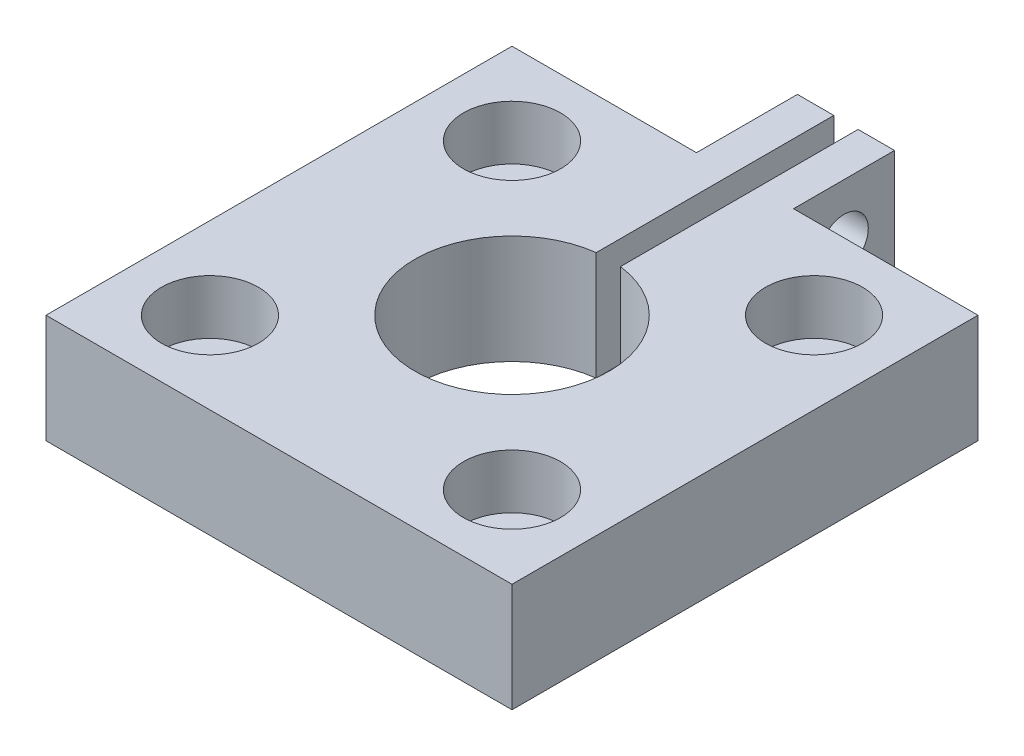
ISO-10303-21;
HEADER;
FILE_DESCRIPTION(('STEP AP214'),'2;1');
FILE_NAME('part.step','',(''),(''),'','','');
FILE_SCHEMA(('AUTOMOTIVE_DESIGN { 1 0 10303 214 1 1 1 1 }'));
ENDSEC;
DATA;
#1=APPLICATION_CONTEXT('core data for automotive mechanical design processes');
#2=APPLICATION_PROTOCOL_DEFINITION('international standard','automotive_design',2000,#1);
#3=PRODUCT_CONTEXT('',#1,'mechanical');
#4=PRODUCT('Part','Part','',(#3));
#5=PRODUCT_RELATED_PRODUCT_CATEGORY('part','',(#4));
#6=PRODUCT_DEFINITION_FORMATION('','',#4);
#7=PRODUCT_DEFINITION_CONTEXT('part definition',#1,'design');
#8=PRODUCT_DEFINITION('design','',#6,#7);
#9=PRODUCT_DEFINITION_SHAPE('','',#8);
#10=(LENGTH_UNIT() NAMED_UNIT(*) SI_UNIT(.MILLI.,.METRE.));
#11=(NAMED_UNIT(*) PLANE_ANGLE_UNIT() SI_UNIT($,.RADIAN.));
#12=(NAMED_UNIT(*) SI_UNIT($,.STERADIAN.) SOLID_ANGLE_UNIT());
#13=UNCERTAINTY_MEASURE_WITH_UNIT(LENGTH_MEASURE(1.E-05),#10,'distance_accuracy_value','');
#14=(GEOMETRIC_REPRESENTATION_CONTEXT(3) GLOBAL_UNCERTAINTY_ASSIGNED_CONTEXT((#13)) GLOBAL_UNIT_ASSIGNED_CONTEXT((#10,
#11,#12)) REPRESENTATION_CONTEXT('',''));
#15=CARTESIAN_POINT('',(0.,0.,0.));
#16=DIRECTION('',(0.,0.,1.));
#17=DIRECTION('',(1.,0.,0.));
#18=AXIS2_PLACEMENT_3D('',#15,#16,#17);
#19=CARTESIAN_POINT('',(4.93914086658801,0.,4.93914086658806));
#20=DIRECTION('',(0.,1.,0.));
#21=DIRECTION('',(0.,0.,1.));
#22=AXIS2_PLACEMENT_3D('',#19,#20,#21);
#23=CYLINDRICAL_SURFACE('',#22,0.79375);
#24=CARTESIAN_POINT('',(4.93914086658801,0.,4.93914086658806));
#25=DIRECTION('',(0.,1.,0.));
#26=DIRECTION('',(0.,0.,1.));
#27=AXIS2_PLACEMENT_3D('',#24,#25,#26);
#28=CIRCLE('',#27,0.79375);
#29=CARTESIAN_POINT('',(4.93914086658801,0.,5.73289086658806));
#30=VERTEX_POINT('',#29);
#31=EDGE_CURVE('E260',#30,#30,#28,.T.);
#32=ORIENTED_EDGE('',*,*,#31,.F.);
#33=EDGE_LOOP('',(#32));
#34=FACE_BOUND('',#33,.T.);
#35=CARTESIAN_POINT('',(4.93914086658801,1.778,4.93914086658806));
#36=DIRECTION('',(0.,1.,0.));
#37=DIRECTION('',(0.,0.,1.));
#38=AXIS2_PLACEMENT_3D('',#35,#36,#37);
#39=CIRCLE('',#38,0.79375);
#40=CARTESIAN_POINT('',(4.93914086658801,1.778,5.73289086658806));
#41=VERTEX_POINT('',#40);
#42=EDGE_CURVE('E39',#41,#41,#39,.F.);
#43=ORIENTED_EDGE('',*,*,#42,.F.);
#44=EDGE_LOOP('',(#43));
#45=FACE_BOUND('',#44,.T.);
#46=ADVANCED_FACE('F35',(#34,#45),#23,.F.);
#47=CARTESIAN_POINT('',(-4.93914086658805,0.,4.93914086658801));
#48=DIRECTION('',(0.,1.,0.));
#49=DIRECTION('',(0.,0.,1.));
#50=AXIS2_PLACEMENT_3D('',#47,#48,#49);
#51=CYLINDRICAL_SURFACE('',#50,0.79375);
#52=CARTESIAN_POINT('',(-4.93914086658805,0.,4.93914086658801));
#53=DIRECTION('',(0.,1.,0.));
#54=DIRECTION('',(0.,0.,1.));
#55=AXIS2_PLACEMENT_3D('',#52,#53,#54);
#56=CIRCLE('',#55,0.79375);
#57=CARTESIAN_POINT('',(-4.93914086658805,0.,5.73289086658801));
#58=VERTEX_POINT('',#57);
#59=EDGE_CURVE('E257',#58,#58,#56,.T.);
#60=ORIENTED_EDGE('',*,*,#59,.F.);
#61=EDGE_LOOP('',(#60));
#62=FACE_BOUND('',#61,.T.);
#63=CARTESIAN_POINT('',(-4.93914086658805,1.778,4.93914086658801));
#64=DIRECTION('',(0.,1.,0.));
#65=DIRECTION('',(0.,0.,1.));
#66=AXIS2_PLACEMENT_3D('',#63,#64,#65);
#67=CIRCLE('',#66,0.79375);
#68=CARTESIAN_POINT('',(-4.93914086658805,1.778,5.73289086658801));
#69=VERTEX_POINT('',#68);
#70=EDGE_CURVE('E222',#69,#69,#67,.F.);
#71=ORIENTED_EDGE('',*,*,#70,.F.);
#72=EDGE_LOOP('',(#71));
#73=FACE_BOUND('',#72,.T.);
#74=ADVANCED_FACE('F318',(#62,#73),#51,.F.);
#75=CARTESIAN_POINT('',(4.93914086658806,0.,-4.93914086658801));
#76=DIRECTION('',(0.,1.,0.));
#77=DIRECTION('',(0.,0.,1.));
#78=AXIS2_PLACEMENT_3D('',#75,#76,#77);
#79=CYLINDRICAL_SURFACE('',#78,0.79375);
#80=CARTESIAN_POINT('',(4.93914086658806,0.,-4.93914086658801));
#81=DIRECTION('',(0.,1.,0.));
#82=DIRECTION('',(0.,0.,1.));
#83=AXIS2_PLACEMENT_3D('',#80,#81,#82);
#84=CIRCLE('',#83,0.79375);
#85=CARTESIAN_POINT('',(4.93914086658806,0.,-4.14539086658801));
#86=VERTEX_POINT('',#85);
#87=EDGE_CURVE('E167',#86,#86,#84,.T.);
#88=ORIENTED_EDGE('',*,*,#87,.F.);
#89=EDGE_LOOP('',(#88));
#90=FACE_BOUND('',#89,.T.);
#91=CARTESIAN_POINT('',(4.93914086658806,1.778,-4.93914086658801));
#92=DIRECTION('',(0.,1.,0.));
#93=DIRECTION('',(0.,0.,1.));
#94=AXIS2_PLACEMENT_3D('',#91,#92,#93);
#95=CIRCLE('',#94,0.79375);
#96=CARTESIAN_POINT('',(4.93914086658806,1.778,-4.14539086658801));
#97=VERTEX_POINT('',#96);
#98=EDGE_CURVE('E218',#97,#97,#95,.F.);
#99=ORIENTED_EDGE('',*,*,#98,.F.);
#100=EDGE_LOOP('',(#99));
#101=FACE_BOUND('',#100,.T.);
#102=ADVANCED_FACE('F314',(#90,#101),#79,.F.);
#103=CARTESIAN_POINT('',(-4.93914086658801,0.,-4.93914086658806));
#104=DIRECTION('',(0.,1.,0.));
#105=DIRECTION('',(0.,0.,1.));
#106=AXIS2_PLACEMENT_3D('',#103,#104,#105);
#107=CYLINDRICAL_SURFACE('',#106,0.79375);
#108=CARTESIAN_POINT('',(-4.93914086658801,0.,-4.93914086658806));
#109=DIRECTION('',(0.,1.,0.));
#110=DIRECTION('',(0.,0.,1.));
#111=AXIS2_PLACEMENT_3D('',#108,#109,#110);
#112=CIRCLE('',#111,0.79375);
#113=CARTESIAN_POINT('',(-4.93914086658801,0.,-4.14539086658806));
#114=VERTEX_POINT('',#113);
#115=EDGE_CURVE('E261',#114,#114,#112,.T.);
#116=ORIENTED_EDGE('',*,*,#115,.F.);
#117=EDGE_LOOP('',(#116));
#118=FACE_BOUND('',#117,.T.);
#119=CARTESIAN_POINT('',(-4.93914086658801,1.778,-4.93914086658806));
#120=DIRECTION('',(0.,1.,0.));
#121=DIRECTION('',(0.,0.,1.));
#122=AXIS2_PLACEMENT_3D('',#119,#120,#121);
#123=CIRCLE('',#122,0.79375);
#124=CARTESIAN_POINT('',(-4.93914086658801,1.778,-4.14539086658806));
#125=VERTEX_POINT('',#124);
#126=EDGE_CURVE('E213',#125,#125,#123,.F.);
#127=ORIENTED_EDGE('',*,*,#126,.F.);
#128=EDGE_LOOP('',(#127));
#129=FACE_BOUND('',#128,.T.);
#130=ADVANCED_FACE('F305',(#118,#129),#107,.F.);
#131=CARTESIAN_POINT('',(-1.5875,3.556,0.));
#132=DIRECTION('',(-1.,0.,0.));
#133=DIRECTION('',(0.,0.,1.));
#134=AXIS2_PLACEMENT_3D('',#131,#132,#133);
#135=PLANE('',#134);
#136=CARTESIAN_POINT('',(-1.5875,1.778,-9.271));
#137=DIRECTION('',(1.,0.,0.));
#138=DIRECTION('',(0.,0.,-1.));
#139=AXIS2_PLACEMENT_3D('',#136,#137,#138);
#140=CIRCLE('',#139,0.793749999999999);
#141=CARTESIAN_POINT('',(-1.5875,1.778,-10.06475));
#142=VERTEX_POINT('',#141);
#143=EDGE_CURVE('E212',#142,#142,#140,.T.);
#144=ORIENTED_EDGE('',*,*,#143,.T.);
#145=EDGE_LOOP('',(#144));
#146=FACE_BOUND('',#145,.T.);
#147=DIRECTION('',(0.,0.,-1.));
#148=VECTOR('',#147,1.);
#149=CARTESIAN_POINT('',(-1.5875,0.,0.));
#150=LINE('',#149,#148);
#151=CARTESIAN_POINT('',(-1.5875,0.,-7.62));
#152=VERTEX_POINT('',#151);
#153=CARTESIAN_POINT('',(-1.5875,0.,-10.922));
#154=VERTEX_POINT('',#153);
#155=EDGE_CURVE('E166',#152,#154,#150,.T.);
#156=ORIENTED_EDGE('',*,*,#155,.F.);
#157=DIRECTION('',(0.,-1.,0.));
#158=VECTOR('',#157,1.);
#159=CARTESIAN_POINT('',(-1.5875,3.556,-7.62));
#160=LINE('',#159,#158);
#161=CARTESIAN_POINT('',(-1.5875,3.556,-7.62));
#162=VERTEX_POINT('',#161);
#163=EDGE_CURVE('E11',#162,#152,#160,.T.);
#164=ORIENTED_EDGE('',*,*,#163,.F.);
#165=DIRECTION('',(0.,0.,-1.));
#166=VECTOR('',#165,1.);
#167=CARTESIAN_POINT('',(-1.5875,3.556,0.));
#168=LINE('',#167,#166);
#169=CARTESIAN_POINT('',(-1.5875,3.556,-10.922));
#170=VERTEX_POINT('',#169);
#171=EDGE_CURVE('E269',#162,#170,#168,.T.);
#172=ORIENTED_EDGE('',*,*,#171,.T.);
#173=DIRECTION('',(0.,-1.,0.));
#174=VECTOR('',#173,1.);
#175=CARTESIAN_POINT('',(-1.5875,3.556,-10.922));
#176=LINE('',#175,#174);
#177=EDGE_CURVE('E61',#170,#154,#176,.T.);
#178=ORIENTED_EDGE('',*,*,#177,.T.);
#179=EDGE_LOOP('',(#156,#164,#172,#178));
#180=FACE_BOUND('',#179,.T.);
#181=ADVANCED_FACE('F302',(#146,#180),#135,.T.);
#182=CARTESIAN_POINT('',(0.,3.556,-7.62));
#183=DIRECTION('',(0.,0.,1.));
#184=DIRECTION('',(1.,0.,0.));
#185=AXIS2_PLACEMENT_3D('',#182,#183,#184);
#186=PLANE('',#185);
#187=DIRECTION('',(-1.,0.,0.));
#188=VECTOR('',#187,1.);
#189=CARTESIAN_POINT('',(0.,0.,-7.62));
#190=LINE('',#189,#188);
#191=CARTESIAN_POINT('',(-7.62,0.,-7.62));
#192=VERTEX_POINT('',#191);
#193=EDGE_CURVE('E169',#152,#192,#190,.T.);
#194=ORIENTED_EDGE('',*,*,#193,.T.);
#195=DIRECTION('',(0.,-1.,0.));
#196=VECTOR('',#195,1.);
#197=CARTESIAN_POINT('',(-7.62,3.556,-7.62));
#198=LINE('',#197,#196);
#199=CARTESIAN_POINT('',(-7.62,3.556,-7.62));
#200=VERTEX_POINT('',#199);
#201=EDGE_CURVE('E44',#200,#192,#198,.T.);
#202=ORIENTED_EDGE('',*,*,#201,.F.);
#203=DIRECTION('',(-1.,0.,0.));
#204=VECTOR('',#203,1.);
#205=CARTESIAN_POINT('',(0.,3.556,-7.62));
#206=LINE('',#205,#204);
#207=EDGE_CURVE('E271',#162,#200,#206,.T.);
#208=ORIENTED_EDGE('',*,*,#207,.F.);
#209=ORIENTED_EDGE('',*,*,#163,.T.);
#210=EDGE_LOOP('',(#194,#202,#208,#209));
#211=FACE_BOUND('',#210,.T.);
#212=ADVANCED_FACE('F304',(#211),#186,.F.);
#213=CARTESIAN_POINT('',(-7.62,3.556,0.));
#214=DIRECTION('',(1.,0.,0.));
#215=DIRECTION('',(0.,0.,-1.));
#216=AXIS2_PLACEMENT_3D('',#213,#214,#215);
#217=PLANE('',#216);
#218=DIRECTION('',(0.,0.,1.));
#219=VECTOR('',#218,1.);
#220=CARTESIAN_POINT('',(-7.62,0.,0.));
#221=LINE('',#220,#219);
#222=CARTESIAN_POINT('',(-7.62,0.,7.62));
#223=VERTEX_POINT('',#222);
#224=EDGE_CURVE('E172',#192,#223,#221,.T.);
#225=ORIENTED_EDGE('',*,*,#224,.T.);
#226=DIRECTION('',(0.,-1.,0.));
#227=VECTOR('',#226,1.);
#228=CARTESIAN_POINT('',(-7.62,3.556,7.62));
#229=LINE('',#228,#227);
#230=CARTESIAN_POINT('',(-7.62,3.556,7.62));
#231=VERTEX_POINT('',#230);
#232=EDGE_CURVE('E204',#231,#223,#229,.T.);
#233=ORIENTED_EDGE('',*,*,#232,.F.);
#234=DIRECTION('',(0.,0.,1.));
#235=VECTOR('',#234,1.);
#236=CARTESIAN_POINT('',(-7.62,3.556,0.));
#237=LINE('',#236,#235);
#238=EDGE_CURVE('E274',#200,#231,#237,.T.);
#239=ORIENTED_EDGE('',*,*,#238,.F.);
#240=ORIENTED_EDGE('',*,*,#201,.T.);
#241=EDGE_LOOP('',(#225,#233,#239,#240));
#242=FACE_BOUND('',#241,.T.);
#243=ADVANCED_FACE('F311',(#242),#217,.F.);
#244=CARTESIAN_POINT('',(0.,3.556,7.62));
#245=DIRECTION('',(0.,0.,1.));
#246=DIRECTION('',(1.,0.,0.));
#247=AXIS2_PLACEMENT_3D('',#244,#245,#246);
#248=PLANE('',#247);
#249=DIRECTION('',(-1.,0.,0.));
#250=VECTOR('',#249,1.);
#251=CARTESIAN_POINT('',(0.,0.,7.62));
#252=LINE('',#251,#250);
#253=CARTESIAN_POINT('',(7.62,0.,7.62));
#254=VERTEX_POINT('',#253);
#255=EDGE_CURVE('E175',#254,#223,#252,.T.);
#256=ORIENTED_EDGE('',*,*,#255,.F.);
#257=DIRECTION('',(0.,-1.,0.));
#258=VECTOR('',#257,1.);
#259=CARTESIAN_POINT('',(7.62,3.556,7.62));
#260=LINE('',#259,#258);
#261=CARTESIAN_POINT('',(7.62,3.556,7.62));
#262=VERTEX_POINT('',#261);
#263=EDGE_CURVE('E202',#262,#254,#260,.T.);
#264=ORIENTED_EDGE('',*,*,#263,.F.);
#265=DIRECTION('',(-1.,0.,0.));
#266=VECTOR('',#265,1.);
#267=CARTESIAN_POINT('',(0.,3.556,7.62));
#268=LINE('',#267,#266);
#269=EDGE_CURVE('E276',#262,#231,#268,.T.);
#270=ORIENTED_EDGE('',*,*,#269,.T.);
#271=ORIENTED_EDGE('',*,*,#232,.T.);
#272=EDGE_LOOP('',(#256,#264,#270,#271));
#273=FACE_BOUND('',#272,.T.);
#274=ADVANCED_FACE('F357',(#273),#248,.T.);
#275=CARTESIAN_POINT('',(7.62,3.556,0.));
#276=DIRECTION('',(1.,0.,0.));
#277=DIRECTION('',(0.,0.,-1.));
#278=AXIS2_PLACEMENT_3D('',#275,#276,#277);
#279=PLANE('',#278);
#280=DIRECTION('',(0.,0.,1.));
#281=VECTOR('',#280,1.);
#282=CARTESIAN_POINT('',(7.62,0.,0.));
#283=LINE('',#282,#281);
#284=CARTESIAN_POINT('',(7.62,0.,-7.62));
#285=VERTEX_POINT('',#284);
#286=EDGE_CURVE('E178',#285,#254,#283,.T.);
#287=ORIENTED_EDGE('',*,*,#286,.F.);
#288=DIRECTION('',(0.,-1.,0.));
#289=VECTOR('',#288,1.);
#290=CARTESIAN_POINT('',(7.62,3.556,-7.62));
#291=LINE('',#290,#289);
#292=CARTESIAN_POINT('',(7.62,3.556,-7.62));
#293=VERTEX_POINT('',#292);
#294=EDGE_CURVE('E200',#293,#285,#291,.T.);
#295=ORIENTED_EDGE('',*,*,#294,.F.);
#296=DIRECTION('',(0.,0.,1.));
#297=VECTOR('',#296,1.);
#298=CARTESIAN_POINT('',(7.62,3.556,0.));
#299=LINE('',#298,#297);
#300=EDGE_CURVE('E279',#293,#262,#299,.T.);
#301=ORIENTED_EDGE('',*,*,#300,.T.);
#302=ORIENTED_EDGE('',*,*,#263,.T.);
#303=EDGE_LOOP('',(#287,#295,#301,#302));
#304=FACE_BOUND('',#303,.T.);
#305=ADVANCED_FACE('F354',(#304),#279,.T.);
#306=CARTESIAN_POINT('',(0.,3.556,-7.62));
#307=DIRECTION('',(0.,0.,1.));
#308=DIRECTION('',(1.,0.,0.));
#309=AXIS2_PLACEMENT_3D('',#306,#307,#308);
#310=PLANE('',#309);
#311=DIRECTION('',(-1.,0.,0.));
#312=VECTOR('',#311,1.);
#313=CARTESIAN_POINT('',(0.,0.,-7.62));
#314=LINE('',#313,#312);
#315=CARTESIAN_POINT('',(1.5875,0.,-7.62));
#316=VERTEX_POINT('',#315);
#317=EDGE_CURVE('E181',#285,#316,#314,.T.);
#318=ORIENTED_EDGE('',*,*,#317,.T.);
#319=DIRECTION('',(0.,-1.,0.));
#320=VECTOR('',#319,1.);
#321=CARTESIAN_POINT('',(1.5875,3.556,-7.62));
#322=LINE('',#321,#320);
#323=CARTESIAN_POINT('',(1.5875,3.556,-7.62));
#324=VERTEX_POINT('',#323);
#325=EDGE_CURVE('E197',#324,#316,#322,.T.);
#326=ORIENTED_EDGE('',*,*,#325,.F.);
#327=DIRECTION('',(-1.,0.,0.));
#328=VECTOR('',#327,1.);
#329=CARTESIAN_POINT('',(0.,3.556,-7.62));
#330=LINE('',#329,#328);
#331=EDGE_CURVE('E156',#293,#324,#330,.T.);
#332=ORIENTED_EDGE('',*,*,#331,.F.);
#333=ORIENTED_EDGE('',*,*,#294,.T.);
#334=EDGE_LOOP('',(#318,#326,#332,#333));
#335=FACE_BOUND('',#334,.T.);
#336=ADVANCED_FACE('F286',(#335),#310,.F.);
#337=CARTESIAN_POINT('',(1.5875,3.556,0.));
#338=DIRECTION('',(-1.,0.,0.));
#339=DIRECTION('',(0.,0.,1.));
#340=AXIS2_PLACEMENT_3D('',#337,#338,#339);
#341=PLANE('',#340);
#342=CARTESIAN_POINT('',(1.5875,1.778,-9.271));
#343=DIRECTION('',(1.,0.,0.));
#344=DIRECTION('',(0.,0.,-1.));
#345=AXIS2_PLACEMENT_3D('',#342,#343,#344);
#346=CIRCLE('',#345,0.793749999999999);
#347=CARTESIAN_POINT('',(1.5875,1.778,-10.06475));
#348=VERTEX_POINT('',#347);
#349=EDGE_CURVE('E248',#348,#348,#346,.T.);
#350=ORIENTED_EDGE('',*,*,#349,.F.);
#351=EDGE_LOOP('',(#350));
#352=FACE_BOUND('',#351,.T.);
#353=DIRECTION('',(0.,0.,-1.));
#354=VECTOR('',#353,1.);
#355=CARTESIAN_POINT('',(1.5875,0.,0.));
#356=LINE('',#355,#354);
#357=CARTESIAN_POINT('',(1.5875,0.,-10.922));
#358=VERTEX_POINT('',#357);
#359=EDGE_CURVE('E184',#316,#358,#356,.T.);
#360=ORIENTED_EDGE('',*,*,#359,.T.);
#361=DIRECTION('',(0.,-1.,0.));
#362=VECTOR('',#361,1.);
#363=CARTESIAN_POINT('',(1.5875,3.556,-10.922));
#364=LINE('',#363,#362);
#365=CARTESIAN_POINT('',(1.5875,3.556,-10.922));
#366=VERTEX_POINT('',#365);
#367=EDGE_CURVE('E137',#366,#358,#364,.T.);
#368=ORIENTED_EDGE('',*,*,#367,.F.);
#369=DIRECTION('',(0.,0.,-1.));
#370=VECTOR('',#369,1.);
#371=CARTESIAN_POINT('',(1.5875,3.556,0.));
#372=LINE('',#371,#370);
#373=EDGE_CURVE('E153',#324,#366,#372,.T.);
#374=ORIENTED_EDGE('',*,*,#373,.F.);
#375=ORIENTED_EDGE('',*,*,#325,.T.);
#376=EDGE_LOOP('',(#360,#368,#374,#375));
#377=FACE_BOUND('',#376,.T.);
#378=ADVANCED_FACE('F289',(#352,#377),#341,.F.);
#379=CARTESIAN_POINT('',(0.,3.556,-10.922));
#380=DIRECTION('',(0.,0.,-1.));
#381=DIRECTION('',(-1.,0.,0.));
#382=AXIS2_PLACEMENT_3D('',#379,#380,#381);
#383=PLANE('',#382);
#384=DIRECTION('',(1.,0.,0.));
#385=VECTOR('',#384,1.);
#386=CARTESIAN_POINT('',(0.,0.,-10.922));
#387=LINE('',#386,#385);
#388=CARTESIAN_POINT('',(0.396875,0.,-10.922));
#389=VERTEX_POINT('',#388);
#390=EDGE_CURVE('E133',#389,#358,#387,.T.);
#391=ORIENTED_EDGE('',*,*,#390,.F.);
#392=DIRECTION('',(0.,-1.,0.));
#393=VECTOR('',#392,1.);
#394=CARTESIAN_POINT('',(0.396875,3.556,-10.922));
#395=LINE('',#394,#393);
#396=CARTESIAN_POINT('',(0.396875,3.556,-10.922));
#397=VERTEX_POINT('',#396);
#398=EDGE_CURVE('E127',#397,#389,#395,.T.);
#399=ORIENTED_EDGE('',*,*,#398,.F.);
#400=DIRECTION('',(1.,0.,0.));
#401=VECTOR('',#400,1.);
#402=CARTESIAN_POINT('',(0.,3.556,-10.922));
#403=LINE('',#402,#401);
#404=EDGE_CURVE('E131',#397,#366,#403,.T.);
#405=ORIENTED_EDGE('',*,*,#404,.T.);
#406=ORIENTED_EDGE('',*,*,#367,.T.);
#407=EDGE_LOOP('',(#391,#399,#405,#406));
#408=FACE_BOUND('',#407,.T.);
#409=ADVANCED_FACE('F129',(#408),#383,.T.);
#410=CARTESIAN_POINT('',(0.396875000000002,3.556,0.));
#411=DIRECTION('',(1.,0.,0.));
#412=DIRECTION('',(0.,0.,-1.));
#413=AXIS2_PLACEMENT_3D('',#410,#411,#412);
#414=PLANE('',#413);
#415=CARTESIAN_POINT('',(0.396875,1.778,-9.271));
#416=DIRECTION('',(1.,0.,0.));
#417=DIRECTION('',(0.,0.,-1.));
#418=AXIS2_PLACEMENT_3D('',#415,#416,#417);
#419=CIRCLE('',#418,0.793749999999999);
#420=CARTESIAN_POINT('',(0.396875,1.778,-10.06475));
#421=VERTEX_POINT('',#420);
#422=EDGE_CURVE('E211',#421,#421,#419,.T.);
#423=ORIENTED_EDGE('',*,*,#422,.T.);
#424=EDGE_LOOP('',(#423));
#425=FACE_BOUND('',#424,.T.);
#426=DIRECTION('',(0.,0.,1.));
#427=VECTOR('',#426,1.);
#428=CARTESIAN_POINT('',(0.396875000000002,0.,0.));
#429=LINE('',#428,#427);
#430=CARTESIAN_POINT('',(0.396875,0.,-3.15009765473628));
#431=VERTEX_POINT('',#430);
#432=EDGE_CURVE('E188',#389,#431,#429,.T.);
#433=ORIENTED_EDGE('',*,*,#432,.T.);
#434=DIRECTION('',(0.,1.,0.));
#435=VECTOR('',#434,1.);
#436=CARTESIAN_POINT('',(0.396875,0.,-3.15009765473628));
#437=LINE('',#436,#435);
#438=CARTESIAN_POINT('',(0.396875,3.556,-3.15009765473628));
#439=VERTEX_POINT('',#438);
#440=EDGE_CURVE('E145',#431,#439,#437,.T.);
#441=ORIENTED_EDGE('',*,*,#440,.T.);
#442=DIRECTION('',(0.,0.,1.));
#443=VECTOR('',#442,1.);
#444=CARTESIAN_POINT('',(0.396875000000002,3.556,0.));
#445=LINE('',#444,#443);
#446=EDGE_CURVE('E142',#397,#439,#445,.T.);
#447=ORIENTED_EDGE('',*,*,#446,.F.);
#448=ORIENTED_EDGE('',*,*,#398,.T.);
#449=EDGE_LOOP('',(#433,#441,#447,#448));
#450=FACE_BOUND('',#449,.T.);
#451=ADVANCED_FACE('F143',(#425,#450),#414,.F.);
#452=CARTESIAN_POINT('',(-0.396875000000002,3.556,0.));
#453=DIRECTION('',(1.,0.,0.));
#454=DIRECTION('',(0.,0.,-1.));
#455=AXIS2_PLACEMENT_3D('',#452,#453,#454);
#456=PLANE('',#455);
#457=CARTESIAN_POINT('',(-0.396875,1.778,-9.271));
#458=DIRECTION('',(1.,0.,0.));
#459=DIRECTION('',(0.,0.,-1.));
#460=AXIS2_PLACEMENT_3D('',#457,#458,#459);
#461=CIRCLE('',#460,0.793749999999999);
#462=CARTESIAN_POINT('',(-0.396875,1.778,-10.06475));
#463=VERTEX_POINT('',#462);
#464=EDGE_CURVE('E208',#463,#463,#461,.T.);
#465=ORIENTED_EDGE('',*,*,#464,.F.);
#466=EDGE_LOOP('',(#465));
#467=FACE_BOUND('',#466,.T.);
#468=DIRECTION('',(0.,0.,1.));
#469=VECTOR('',#468,1.);
#470=CARTESIAN_POINT('',(-0.396875000000002,0.,0.));
#471=LINE('',#470,#469);
#472=CARTESIAN_POINT('',(-0.396875,0.,-10.922));
#473=VERTEX_POINT('',#472);
#474=CARTESIAN_POINT('',(-0.396875,0.,-3.15009765473628));
#475=VERTEX_POINT('',#474);
#476=EDGE_CURVE('E52',#473,#475,#471,.T.);
#477=ORIENTED_EDGE('',*,*,#476,.F.);
#478=DIRECTION('',(0.,-1.,0.));
#479=VECTOR('',#478,1.);
#480=CARTESIAN_POINT('',(-0.396875,3.556,-10.922));
#481=LINE('',#480,#479);
#482=CARTESIAN_POINT('',(-0.396875,3.556,-10.922));
#483=VERTEX_POINT('',#482);
#484=EDGE_CURVE('E138',#483,#473,#481,.T.);
#485=ORIENTED_EDGE('',*,*,#484,.F.);
#486=DIRECTION('',(0.,0.,1.));
#487=VECTOR('',#486,1.);
#488=CARTESIAN_POINT('',(-0.396875000000002,3.556,0.));
#489=LINE('',#488,#487);
#490=CARTESIAN_POINT('',(-0.396875,3.556,-3.15009765473628));
#491=VERTEX_POINT('',#490);
#492=EDGE_CURVE('E149',#483,#491,#489,.T.);
#493=ORIENTED_EDGE('',*,*,#492,.T.);
#494=DIRECTION('',(0.,1.,0.));
#495=VECTOR('',#494,1.);
#496=CARTESIAN_POINT('',(-0.396875,0.,-3.15009765473628));
#497=LINE('',#496,#495);
#498=EDGE_CURVE('E216',#475,#491,#497,.T.);
#499=ORIENTED_EDGE('',*,*,#498,.F.);
#500=EDGE_LOOP('',(#477,#485,#493,#499));
#501=FACE_BOUND('',#500,.T.);
#502=ADVANCED_FACE('F298',(#467,#501),#456,.T.);
#503=CARTESIAN_POINT('',(0.,3.556,0.));
#504=DIRECTION('',(0.,-1.,0.));
#505=DIRECTION('',(0.,0.,-1.));
#506=AXIS2_PLACEMENT_3D('',#503,#504,#505);
#507=CYLINDRICAL_SURFACE('',#506,3.175);
#508=ORIENTED_EDGE('',*,*,#498,.T.);
#509=CARTESIAN_POINT('',(0.,3.556,0.));
#510=DIRECTION('',(0.,1.,0.));
#511=DIRECTION('',(0.,0.,1.));
#512=AXIS2_PLACEMENT_3D('',#509,#510,#511);
#513=CIRCLE('',#512,3.175);
#514=EDGE_CURVE('E193',#491,#439,#513,.T.);
#515=ORIENTED_EDGE('',*,*,#514,.T.);
#516=ORIENTED_EDGE('',*,*,#440,.F.);
#517=CARTESIAN_POINT('',(0.,0.,0.));
#518=DIRECTION('',(0.,1.,0.));
#519=DIRECTION('',(0.,0.,1.));
#520=AXIS2_PLACEMENT_3D('',#517,#518,#519);
#521=CIRCLE('',#520,3.175);
#522=EDGE_CURVE('E164',#475,#431,#521,.T.);
#523=ORIENTED_EDGE('',*,*,#522,.F.);
#524=EDGE_LOOP('',(#508,#515,#516,#523));
#525=FACE_BOUND('',#524,.T.);
#526=ADVANCED_FACE('F37',(#525),#507,.F.);
#527=CARTESIAN_POINT('',(0.,3.556,-10.922));
#528=DIRECTION('',(0.,0.,-1.));
#529=DIRECTION('',(-1.,0.,0.));
#530=AXIS2_PLACEMENT_3D('',#527,#528,#529);
#531=PLANE('',#530);
#532=DIRECTION('',(1.,0.,0.));
#533=VECTOR('',#532,1.);
#534=CARTESIAN_POINT('',(0.,0.,-10.922));
#535=LINE('',#534,#533);
#536=EDGE_CURVE('E191',#154,#473,#535,.T.);
#537=ORIENTED_EDGE('',*,*,#536,.F.);
#538=ORIENTED_EDGE('',*,*,#177,.F.);
#539=DIRECTION('',(1.,0.,0.));
#540=VECTOR('',#539,1.);
#541=CARTESIAN_POINT('',(0.,3.556,-10.922));
#542=LINE('',#541,#540);
#543=EDGE_CURVE('E162',#170,#483,#542,.T.);
#544=ORIENTED_EDGE('',*,*,#543,.T.);
#545=ORIENTED_EDGE('',*,*,#484,.T.);
#546=EDGE_LOOP('',(#537,#538,#544,#545));
#547=FACE_BOUND('',#546,.T.);
#548=ADVANCED_FACE('F299',(#547),#531,.T.);
#549=CARTESIAN_POINT('',(0.,3.556,0.));
#550=DIRECTION('',(0.,1.,0.));
#551=DIRECTION('',(0.,0.,1.));
#552=AXIS2_PLACEMENT_3D('',#549,#550,#551);
#553=PLANE('',#552);
#554=CARTESIAN_POINT('',(4.93914086658801,3.556,4.93914086658806));
#555=DIRECTION('',(0.,1.,0.));
#556=DIRECTION('',(0.,0.,-1.));
#557=AXIS2_PLACEMENT_3D('',#554,#555,#556);
#558=CIRCLE('',#557,1.5875);
#559=CARTESIAN_POINT('',(4.93914086658801,3.556,3.35164086658806));
#560=VERTEX_POINT('',#559);
#561=EDGE_CURVE('E238',#560,#560,#558,.T.);
#562=ORIENTED_EDGE('',*,*,#561,.F.);
#563=EDGE_LOOP('',(#562));
#564=FACE_BOUND('',#563,.T.);
#565=CARTESIAN_POINT('',(-4.93914086658801,3.556,4.93914086658806));
#566=DIRECTION('',(0.,-1.,0.));
#567=DIRECTION('',(0.,0.,-1.));
#568=AXIS2_PLACEMENT_3D('',#565,#566,#567);
#569=CIRCLE('',#568,1.5875);
#570=CARTESIAN_POINT('',(-4.93914086658801,3.556,3.35164086658806));
#571=VERTEX_POINT('',#570);
#572=EDGE_CURVE('E231',#571,#571,#569,.T.);
#573=ORIENTED_EDGE('',*,*,#572,.T.);
#574=EDGE_LOOP('',(#573));
#575=FACE_BOUND('',#574,.T.);
#576=CARTESIAN_POINT('',(4.93914086658801,3.556,-4.93914086658806));
#577=DIRECTION('',(0.,-1.,0.));
#578=DIRECTION('',(0.,0.,1.));
#579=AXIS2_PLACEMENT_3D('',#576,#577,#578);
#580=CIRCLE('',#579,1.5875);
#581=CARTESIAN_POINT('',(4.93914086658801,3.556,-3.35164086658806));
#582=VERTEX_POINT('',#581);
#583=EDGE_CURVE('E224',#582,#582,#580,.T.);
#584=ORIENTED_EDGE('',*,*,#583,.T.);
#585=EDGE_LOOP('',(#584));
#586=FACE_BOUND('',#585,.T.);
#587=CARTESIAN_POINT('',(-4.93914086658801,3.556,-4.93914086658806));
#588=DIRECTION('',(0.,1.,0.));
#589=DIRECTION('',(0.,0.,1.));
#590=AXIS2_PLACEMENT_3D('',#587,#588,#589);
#591=CIRCLE('',#590,1.5875);
#592=CARTESIAN_POINT('',(-4.93914086658801,3.556,-3.35164086658806));
#593=VERTEX_POINT('',#592);
#594=EDGE_CURVE('E220',#593,#593,#591,.T.);
#595=ORIENTED_EDGE('',*,*,#594,.F.);
#596=EDGE_LOOP('',(#595));
#597=FACE_BOUND('',#596,.T.);
#598=ORIENTED_EDGE('',*,*,#514,.F.);
#599=ORIENTED_EDGE('',*,*,#492,.F.);
#600=ORIENTED_EDGE('',*,*,#543,.F.);
#601=ORIENTED_EDGE('',*,*,#171,.F.);
#602=ORIENTED_EDGE('',*,*,#207,.T.);
#603=ORIENTED_EDGE('',*,*,#238,.T.);
#604=ORIENTED_EDGE('',*,*,#269,.F.);
#605=ORIENTED_EDGE('',*,*,#300,.F.);
#606=ORIENTED_EDGE('',*,*,#331,.T.);
#607=ORIENTED_EDGE('',*,*,#373,.T.);
#608=ORIENTED_EDGE('',*,*,#404,.F.);
#609=ORIENTED_EDGE('',*,*,#446,.T.);
#610=EDGE_LOOP('',(#598,#599,#600,#601,#602,#603,#604,#605,#606,#607,#608,#609));
#611=FACE_BOUND('',#610,.T.);
#612=ADVANCED_FACE('F151',(#564,#575,#586,#597,#611),#553,.T.);
#613=CARTESIAN_POINT('',(0.,0.,0.));
#614=DIRECTION('',(0.,1.,0.));
#615=DIRECTION('',(0.,0.,1.));
#616=AXIS2_PLACEMENT_3D('',#613,#614,#615);
#617=PLANE('',#616);
#618=ORIENTED_EDGE('',*,*,#115,.T.);
#619=EDGE_LOOP('',(#618));
#620=FACE_BOUND('',#619,.T.);
#621=ORIENTED_EDGE('',*,*,#31,.T.);
#622=EDGE_LOOP('',(#621));
#623=FACE_BOUND('',#622,.T.);
#624=ORIENTED_EDGE('',*,*,#59,.T.);
#625=EDGE_LOOP('',(#624));
#626=FACE_BOUND('',#625,.T.);
#627=ORIENTED_EDGE('',*,*,#87,.T.);
#628=EDGE_LOOP('',(#627));
#629=FACE_BOUND('',#628,.T.);
#630=ORIENTED_EDGE('',*,*,#476,.T.);
#631=ORIENTED_EDGE('',*,*,#522,.T.);
#632=ORIENTED_EDGE('',*,*,#432,.F.);
#633=ORIENTED_EDGE('',*,*,#390,.T.);
#634=ORIENTED_EDGE('',*,*,#359,.F.);
#635=ORIENTED_EDGE('',*,*,#317,.F.);
#636=ORIENTED_EDGE('',*,*,#286,.T.);
#637=ORIENTED_EDGE('',*,*,#255,.T.);
#638=ORIENTED_EDGE('',*,*,#224,.F.);
#639=ORIENTED_EDGE('',*,*,#193,.F.);
#640=ORIENTED_EDGE('',*,*,#155,.T.);
#641=ORIENTED_EDGE('',*,*,#536,.T.);
#642=EDGE_LOOP('',(#630,#631,#632,#633,#634,#635,#636,#637,#638,#639,#640,#641));
#643=FACE_BOUND('',#642,.T.);
#644=ADVANCED_FACE('F290',(#620,#623,#626,#629,#643),#617,.F.);
#645=CARTESIAN_POINT('',(-1.5875,1.778,-9.271));
#646=DIRECTION('',(1.,0.,0.));
#647=DIRECTION('',(0.,0.,-1.));
#648=AXIS2_PLACEMENT_3D('',#645,#646,#647);
#649=CYLINDRICAL_SURFACE('',#648,0.793749999999999);
#650=ORIENTED_EDGE('',*,*,#464,.T.);
#651=EDGE_LOOP('',(#650));
#652=FACE_BOUND('',#651,.T.);
#653=ORIENTED_EDGE('',*,*,#143,.F.);
#654=EDGE_LOOP('',(#653));
#655=FACE_BOUND('',#654,.T.);
#656=ADVANCED_FACE('F337',(#652,#655),#649,.F.);
#657=ORIENTED_EDGE('',*,*,#349,.T.);
#658=EDGE_LOOP('',(#657));
#659=FACE_BOUND('',#658,.T.);
#660=ORIENTED_EDGE('',*,*,#422,.F.);
#661=EDGE_LOOP('',(#660));
#662=FACE_BOUND('',#661,.T.);
#663=ADVANCED_FACE('F427',(#659,#662),#649,.F.);
#664=CARTESIAN_POINT('',(-4.93914086658801,1.778,-4.93914086658806));
#665=DIRECTION('',(0.,1.,0.));
#666=DIRECTION('',(0.,0.,1.));
#667=AXIS2_PLACEMENT_3D('',#664,#665,#666);
#668=PLANE('',#667);
#669=CARTESIAN_POINT('',(-4.93914086658801,1.778,-4.93914086658806));
#670=DIRECTION('',(0.,1.,0.));
#671=DIRECTION('',(0.,0.,1.));
#672=AXIS2_PLACEMENT_3D('',#669,#670,#671);
#673=CIRCLE('',#672,1.5875);
#674=CARTESIAN_POINT('',(-4.93914086658801,1.778,-3.35164086658806));
#675=VERTEX_POINT('',#674);
#676=EDGE_CURVE('E217',#675,#675,#673,.T.);
#677=ORIENTED_EDGE('',*,*,#676,.T.);
#678=EDGE_LOOP('',(#677));
#679=FACE_BOUND('',#678,.T.);
#680=ORIENTED_EDGE('',*,*,#126,.T.);
#681=EDGE_LOOP('',(#680));
#682=FACE_BOUND('',#681,.T.);
#683=ADVANCED_FACE('F434',(#679,#682),#668,.T.);
#684=CARTESIAN_POINT('',(-4.93914086658801,1.778,-4.93914086658806));
#685=DIRECTION('',(0.,1.,0.));
#686=DIRECTION('',(0.,0.,1.));
#687=AXIS2_PLACEMENT_3D('',#684,#685,#686);
#688=CYLINDRICAL_SURFACE('',#687,1.5875);
#689=ORIENTED_EDGE('',*,*,#676,.F.);
#690=EDGE_LOOP('',(#689));
#691=FACE_BOUND('',#690,.T.);
#692=ORIENTED_EDGE('',*,*,#594,.T.);
#693=EDGE_LOOP('',(#692));
#694=FACE_BOUND('',#693,.T.);
#695=ADVANCED_FACE('F441',(#691,#694),#688,.F.);
#696=CARTESIAN_POINT('',(4.93914086658801,1.778,-4.93914086658806));
#697=DIRECTION('',(0.,1.,0.));
#698=DIRECTION('',(0.,0.,1.));
#699=AXIS2_PLACEMENT_3D('',#696,#697,#698);
#700=PLANE('',#699);
#701=CARTESIAN_POINT('',(4.93914086658801,1.778,-4.93914086658806));
#702=DIRECTION('',(0.,-1.,0.));
#703=DIRECTION('',(0.,0.,1.));
#704=AXIS2_PLACEMENT_3D('',#701,#702,#703);
#705=CIRCLE('',#704,1.5875);
#706=CARTESIAN_POINT('',(4.93914086658801,1.778,-3.35164086658806));
#707=VERTEX_POINT('',#706);
#708=EDGE_CURVE('E221',#707,#707,#705,.T.);
#709=ORIENTED_EDGE('',*,*,#708,.F.);
#710=EDGE_LOOP('',(#709));
#711=FACE_BOUND('',#710,.T.);
#712=ORIENTED_EDGE('',*,*,#98,.T.);
#713=EDGE_LOOP('',(#712));
#714=FACE_BOUND('',#713,.T.);
#715=ADVANCED_FACE('F449',(#711,#714),#700,.T.);
#716=CARTESIAN_POINT('',(4.93914086658801,1.778,-4.93914086658806));
#717=DIRECTION('',(0.,1.,0.));
#718=DIRECTION('',(0.,0.,1.));
#719=AXIS2_PLACEMENT_3D('',#716,#717,#718);
#720=CYLINDRICAL_SURFACE('',#719,1.5875);
#721=ORIENTED_EDGE('',*,*,#708,.T.);
#722=EDGE_LOOP('',(#721));
#723=FACE_BOUND('',#722,.T.);
#724=ORIENTED_EDGE('',*,*,#583,.F.);
#725=EDGE_LOOP('',(#724));
#726=FACE_BOUND('',#725,.T.);
#727=ADVANCED_FACE('F456',(#723,#726),#720,.F.);
#728=CARTESIAN_POINT('',(-4.93914086658801,1.778,4.93914086658806));
#729=DIRECTION('',(0.,1.,0.));
#730=DIRECTION('',(0.,0.,-1.));
#731=AXIS2_PLACEMENT_3D('',#728,#729,#730);
#732=PLANE('',#731);
#733=CARTESIAN_POINT('',(-4.93914086658801,1.778,4.93914086658806));
#734=DIRECTION('',(0.,-1.,0.));
#735=DIRECTION('',(0.,0.,-1.));
#736=AXIS2_PLACEMENT_3D('',#733,#734,#735);
#737=CIRCLE('',#736,1.5875);
#738=CARTESIAN_POINT('',(-4.93914086658801,1.778,3.35164086658806));
#739=VERTEX_POINT('',#738);
#740=EDGE_CURVE('E225',#739,#739,#737,.T.);
#741=ORIENTED_EDGE('',*,*,#740,.F.);
#742=EDGE_LOOP('',(#741));
#743=FACE_BOUND('',#742,.T.);
#744=ORIENTED_EDGE('',*,*,#70,.T.);
#745=EDGE_LOOP('',(#744));
#746=FACE_BOUND('',#745,.T.);
#747=ADVANCED_FACE('F464',(#743,#746),#732,.T.);
#748=CARTESIAN_POINT('',(-4.93914086658801,1.778,4.93914086658806));
#749=DIRECTION('',(0.,1.,0.));
#750=DIRECTION('',(0.,0.,1.));
#751=AXIS2_PLACEMENT_3D('',#748,#749,#750);
#752=CYLINDRICAL_SURFACE('',#751,1.5875);
#753=ORIENTED_EDGE('',*,*,#740,.T.);
#754=EDGE_LOOP('',(#753));
#755=FACE_BOUND('',#754,.T.);
#756=ORIENTED_EDGE('',*,*,#572,.F.);
#757=EDGE_LOOP('',(#756));
#758=FACE_BOUND('',#757,.T.);
#759=ADVANCED_FACE('F472',(#755,#758),#752,.F.);
#760=CARTESIAN_POINT('',(4.93914086658801,1.778,4.93914086658806));
#761=DIRECTION('',(0.,1.,0.));
#762=DIRECTION('',(0.,0.,-1.));
#763=AXIS2_PLACEMENT_3D('',#760,#761,#762);
#764=PLANE('',#763);
#765=CARTESIAN_POINT('',(4.93914086658801,1.778,4.93914086658806));
#766=DIRECTION('',(0.,1.,0.));
#767=DIRECTION('',(0.,0.,-1.));
#768=AXIS2_PLACEMENT_3D('',#765,#766,#767);
#769=CIRCLE('',#768,1.5875);
#770=CARTESIAN_POINT('',(4.93914086658801,1.778,3.35164086658806));
#771=VERTEX_POINT('',#770);
#772=EDGE_CURVE('E579',#771,#771,#769,.T.);
#773=ORIENTED_EDGE('',*,*,#772,.T.);
#774=EDGE_LOOP('',(#773));
#775=FACE_BOUND('',#774,.T.);
#776=ORIENTED_EDGE('',*,*,#42,.T.);
#777=EDGE_LOOP('',(#776));
#778=FACE_BOUND('',#777,.T.);
#779=ADVANCED_FACE('F480',(#775,#778),#764,.T.);
#780=CARTESIAN_POINT('',(4.93914086658801,1.778,4.93914086658806));
#781=DIRECTION('',(0.,1.,0.));
#782=DIRECTION('',(0.,0.,1.));
#783=AXIS2_PLACEMENT_3D('',#780,#781,#782);
#784=CYLINDRICAL_SURFACE('',#783,1.5875);
#785=ORIENTED_EDGE('',*,*,#772,.F.);
#786=EDGE_LOOP('',(#785));
#787=FACE_BOUND('',#786,.T.);
#788=ORIENTED_EDGE('',*,*,#561,.T.);
#789=EDGE_LOOP('',(#788));
#790=FACE_BOUND('',#789,.T.);
#791=ADVANCED_FACE('F487',(#787,#790),#784,.F.);
#792=CLOSED_SHELL('',(#46,#74,#102,#130,#181,#212,#243,#274,#305,#336,#378,#409,#451,#502,#526,
#548,#612,#644,#656,#663,#683,#695,#715,#727,#747,#759,#779,#791));
#793=MANIFOLD_SOLID_BREP('B2',#792);
#794=ADVANCED_BREP_SHAPE_REPRESENTATION('',(#18,#793),#14);
#795=SHAPE_DEFINITION_REPRESENTATION(#9,#794);
ENDSEC;
END-ISO-10303-21;
